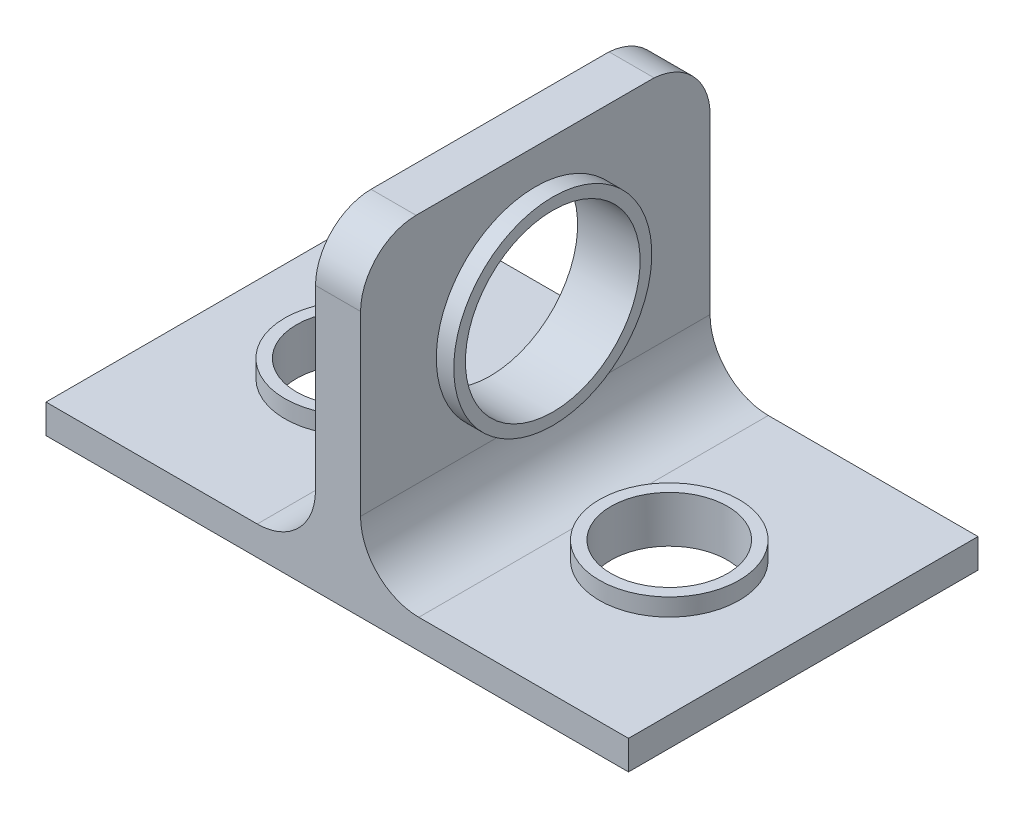
ISO-10303-21;
HEADER;
FILE_DESCRIPTION(('STEP AP214'),'2;1');
FILE_NAME('part.step','',(''),(''),'','','');
FILE_SCHEMA(('AUTOMOTIVE_DESIGN { 1 0 10303 214 1 1 1 1 }'));
ENDSEC;
DATA;
#1=APPLICATION_CONTEXT('core data for automotive mechanical design processes');
#2=APPLICATION_PROTOCOL_DEFINITION('international standard','automotive_design',2000,#1);
#3=PRODUCT_CONTEXT('',#1,'mechanical');
#4=PRODUCT('Part','Part','',(#3));
#5=PRODUCT_RELATED_PRODUCT_CATEGORY('part','',(#4));
#6=PRODUCT_DEFINITION_FORMATION('','',#4);
#7=PRODUCT_DEFINITION_CONTEXT('part definition',#1,'design');
#8=PRODUCT_DEFINITION('design','',#6,#7);
#9=PRODUCT_DEFINITION_SHAPE('','',#8);
#10=(LENGTH_UNIT() NAMED_UNIT(*) SI_UNIT(.MILLI.,.METRE.));
#11=(NAMED_UNIT(*) PLANE_ANGLE_UNIT() SI_UNIT($,.RADIAN.));
#12=(NAMED_UNIT(*) SI_UNIT($,.STERADIAN.) SOLID_ANGLE_UNIT());
#13=UNCERTAINTY_MEASURE_WITH_UNIT(LENGTH_MEASURE(1.E-05),#10,'distance_accuracy_value','');
#14=(GEOMETRIC_REPRESENTATION_CONTEXT(3) GLOBAL_UNCERTAINTY_ASSIGNED_CONTEXT((#13)) GLOBAL_UNIT_ASSIGNED_CONTEXT((#10,
#11,#12)) REPRESENTATION_CONTEXT('',''));
#15=CARTESIAN_POINT('',(0.,0.,0.));
#16=DIRECTION('',(0.,0.,1.));
#17=DIRECTION('',(1.,0.,0.));
#18=AXIS2_PLACEMENT_3D('',#15,#16,#17);
#19=CARTESIAN_POINT('',(-47.4944166202931,-8.60000000000001,60.));
#20=DIRECTION('',(1.,0.,0.));
#21=DIRECTION('',(0.,0.,-1.));
#22=AXIS2_PLACEMENT_3D('',#19,#20,#21);
#23=PLANE('',#22);
#24=DIRECTION('',(0.,-1.,0.));
#25=VECTOR('',#24,1.);
#26=CARTESIAN_POINT('',(-47.4944166202931,-8.60000000000001,0.));
#27=LINE('',#26,#25);
#28=CARTESIAN_POINT('',(-47.4944166202931,-8.60000000000001,0.));
#29=VERTEX_POINT('',#28);
#30=CARTESIAN_POINT('',(-47.4944166202931,-13.6,0.));
#31=VERTEX_POINT('',#30);
#32=EDGE_CURVE('E157',#29,#31,#27,.T.);
#33=ORIENTED_EDGE('',*,*,#32,.T.);
#34=DIRECTION('',(0.,0.,-1.));
#35=VECTOR('',#34,1.);
#36=CARTESIAN_POINT('',(-47.4944166202931,-13.6,60.));
#37=LINE('',#36,#35);
#38=CARTESIAN_POINT('',(-47.4944166202931,-13.6,60.));
#39=VERTEX_POINT('',#38);
#40=EDGE_CURVE('E204',#39,#31,#37,.T.);
#41=ORIENTED_EDGE('',*,*,#40,.F.);
#42=DIRECTION('',(0.,-1.,0.));
#43=VECTOR('',#42,1.);
#44=CARTESIAN_POINT('',(-47.4944166202931,-8.60000000000001,60.));
#45=LINE('',#44,#43);
#46=CARTESIAN_POINT('',(-47.4944166202931,-8.60000000000001,60.));
#47=VERTEX_POINT('',#46);
#48=EDGE_CURVE('E179',#47,#39,#45,.T.);
#49=ORIENTED_EDGE('',*,*,#48,.F.);
#50=DIRECTION('',(0.,0.,-1.));
#51=VECTOR('',#50,1.);
#52=CARTESIAN_POINT('',(-47.4944166202931,-8.60000000000001,60.));
#53=LINE('',#52,#51);
#54=EDGE_CURVE('E156',#47,#29,#53,.T.);
#55=ORIENTED_EDGE('',*,*,#54,.T.);
#56=EDGE_LOOP('',(#33,#41,#49,#55));
#57=FACE_BOUND('',#56,.T.);
#58=ADVANCED_FACE('F35',(#57),#23,.F.);
#59=CARTESIAN_POINT('',(-47.4944166202931,-13.6,60.));
#60=DIRECTION('',(0.,1.,0.));
#61=DIRECTION('',(0.,0.,1.));
#62=AXIS2_PLACEMENT_3D('',#59,#60,#61);
#63=PLANE('',#62);
#64=CARTESIAN_POINT('',(-24.4944166202931,-13.6,30.));
#65=DIRECTION('',(0.,1.,0.));
#66=DIRECTION('',(0.,0.,1.));
#67=AXIS2_PLACEMENT_3D('',#64,#65,#66);
#68=CIRCLE('',#67,10.);
#69=CARTESIAN_POINT('',(-24.4944166202931,-13.6,40.));
#70=VERTEX_POINT('',#69);
#71=EDGE_CURVE('E216',#70,#70,#68,.T.);
#72=ORIENTED_EDGE('',*,*,#71,.T.);
#73=EDGE_LOOP('',(#72));
#74=FACE_BOUND('',#73,.T.);
#75=CARTESIAN_POINT('',(29.5055833797069,-13.6,30.));
#76=DIRECTION('',(0.,1.,0.));
#77=DIRECTION('',(0.,0.,1.));
#78=AXIS2_PLACEMENT_3D('',#75,#76,#77);
#79=CIRCLE('',#78,10.);
#80=CARTESIAN_POINT('',(29.5055833797069,-13.6,40.));
#81=VERTEX_POINT('',#80);
#82=EDGE_CURVE('E213',#81,#81,#79,.T.);
#83=ORIENTED_EDGE('',*,*,#82,.T.);
#84=EDGE_LOOP('',(#83));
#85=FACE_BOUND('',#84,.T.);
#86=DIRECTION('',(1.,0.,0.));
#87=VECTOR('',#86,1.);
#88=CARTESIAN_POINT('',(-47.4944166202931,-13.6,0.));
#89=LINE('',#88,#87);
#90=CARTESIAN_POINT('',(52.5055833797069,-13.6,0.));
#91=VERTEX_POINT('',#90);
#92=EDGE_CURVE('E160',#31,#91,#89,.T.);
#93=ORIENTED_EDGE('',*,*,#92,.T.);
#94=DIRECTION('',(0.,0.,-1.));
#95=VECTOR('',#94,1.);
#96=CARTESIAN_POINT('',(52.5055833797069,-13.6,60.));
#97=LINE('',#96,#95);
#98=CARTESIAN_POINT('',(52.5055833797069,-13.6,60.));
#99=VERTEX_POINT('',#98);
#100=EDGE_CURVE('E201',#99,#91,#97,.T.);
#101=ORIENTED_EDGE('',*,*,#100,.F.);
#102=DIRECTION('',(1.,0.,0.));
#103=VECTOR('',#102,1.);
#104=CARTESIAN_POINT('',(-47.4944166202931,-13.6,60.));
#105=LINE('',#104,#103);
#106=EDGE_CURVE('E244',#39,#99,#105,.T.);
#107=ORIENTED_EDGE('',*,*,#106,.F.);
#108=ORIENTED_EDGE('',*,*,#40,.T.);
#109=EDGE_LOOP('',(#93,#101,#107,#108));
#110=FACE_BOUND('',#109,.T.);
#111=ADVANCED_FACE('F297',(#74,#85,#110),#63,.F.);
#112=CARTESIAN_POINT('',(52.5055833797069,-13.6,60.));
#113=DIRECTION('',(-1.,0.,0.));
#114=DIRECTION('',(0.,0.,1.));
#115=AXIS2_PLACEMENT_3D('',#112,#113,#114);
#116=PLANE('',#115);
#117=DIRECTION('',(0.,1.,0.));
#118=VECTOR('',#117,1.);
#119=CARTESIAN_POINT('',(52.5055833797069,-13.6,0.));
#120=LINE('',#119,#118);
#121=CARTESIAN_POINT('',(52.5055833797069,-8.60000000000001,0.));
#122=VERTEX_POINT('',#121);
#123=EDGE_CURVE('E163',#91,#122,#120,.T.);
#124=ORIENTED_EDGE('',*,*,#123,.T.);
#125=DIRECTION('',(0.,0.,-1.));
#126=VECTOR('',#125,1.);
#127=CARTESIAN_POINT('',(52.5055833797069,-8.60000000000001,60.));
#128=LINE('',#127,#126);
#129=CARTESIAN_POINT('',(52.5055833797069,-8.60000000000001,60.));
#130=VERTEX_POINT('',#129);
#131=EDGE_CURVE('E198',#130,#122,#128,.T.);
#132=ORIENTED_EDGE('',*,*,#131,.F.);
#133=DIRECTION('',(0.,1.,0.));
#134=VECTOR('',#133,1.);
#135=CARTESIAN_POINT('',(52.5055833797069,-13.6,60.));
#136=LINE('',#135,#134);
#137=EDGE_CURVE('E246',#99,#130,#136,.T.);
#138=ORIENTED_EDGE('',*,*,#137,.F.);
#139=ORIENTED_EDGE('',*,*,#100,.T.);
#140=EDGE_LOOP('',(#124,#132,#138,#139));
#141=FACE_BOUND('',#140,.T.);
#142=ADVANCED_FACE('F300',(#141),#116,.F.);
#143=CARTESIAN_POINT('',(52.5055833797069,-8.60000000000001,60.));
#144=DIRECTION('',(0.,-1.,0.));
#145=DIRECTION('',(1.,0.,0.));
#146=AXIS2_PLACEMENT_3D('',#143,#144,#145);
#147=PLANE('',#146);
#148=CARTESIAN_POINT('',(29.5055833797069,-8.60000000000001,30.));
#149=DIRECTION('',(0.,-1.,0.));
#150=DIRECTION('',(1.,0.,0.));
#151=AXIS2_PLACEMENT_3D('',#148,#149,#150);
#152=CIRCLE('',#151,12.);
#153=CARTESIAN_POINT('',(41.5055833797069,-8.60000000000001,30.));
#154=VERTEX_POINT('',#153);
#155=EDGE_CURVE('E210',#154,#154,#152,.F.);
#156=ORIENTED_EDGE('',*,*,#155,.F.);
#157=EDGE_LOOP('',(#156));
#158=FACE_BOUND('',#157,.T.);
#159=DIRECTION('',(-1.,0.,0.));
#160=VECTOR('',#159,1.);
#161=CARTESIAN_POINT('',(52.5055833797069,-8.60000000000001,0.));
#162=LINE('',#161,#160);
#163=CARTESIAN_POINT('',(16.5055833797069,-8.60000000000002,0.));
#164=VERTEX_POINT('',#163);
#165=EDGE_CURVE('E165',#122,#164,#162,.T.);
#166=ORIENTED_EDGE('',*,*,#165,.T.);
#167=DIRECTION('',(0.,0.,-1.));
#168=VECTOR('',#167,1.);
#169=CARTESIAN_POINT('',(16.5055833797069,-8.60000000000002,60.));
#170=LINE('',#169,#168);
#171=CARTESIAN_POINT('',(16.5055833797069,-8.60000000000002,60.));
#172=VERTEX_POINT('',#171);
#173=EDGE_CURVE('E195',#172,#164,#170,.T.);
#174=ORIENTED_EDGE('',*,*,#173,.F.);
#175=DIRECTION('',(-1.,0.,0.));
#176=VECTOR('',#175,1.);
#177=CARTESIAN_POINT('',(52.5055833797069,-8.60000000000001,60.));
#178=LINE('',#177,#176);
#179=EDGE_CURVE('E149',#130,#172,#178,.T.);
#180=ORIENTED_EDGE('',*,*,#179,.F.);
#181=ORIENTED_EDGE('',*,*,#131,.T.);
#182=EDGE_LOOP('',(#166,#174,#180,#181));
#183=FACE_BOUND('',#182,.T.);
#184=ADVANCED_FACE('F252',(#158,#183),#147,.F.);
#185=CARTESIAN_POINT('',(16.5055833797069,1.39999999999998,60.));
#186=DIRECTION('',(0.,0.,-1.));
#187=DIRECTION('',(-1.,0.,0.));
#188=AXIS2_PLACEMENT_3D('',#185,#186,#187);
#189=CYLINDRICAL_SURFACE('',#188,10.);
#190=CARTESIAN_POINT('',(16.5055833797069,1.39999999999998,0.));
#191=DIRECTION('',(0.,0.,-1.));
#192=DIRECTION('',(-1.,0.,0.));
#193=AXIS2_PLACEMENT_3D('',#190,#191,#192);
#194=CIRCLE('',#193,10.);
#195=CARTESIAN_POINT('',(6.50558337970687,1.39999999999998,0.));
#196=VERTEX_POINT('',#195);
#197=EDGE_CURVE('E167',#164,#196,#194,.T.);
#198=ORIENTED_EDGE('',*,*,#197,.T.);
#199=DIRECTION('',(0.,0.,-1.));
#200=VECTOR('',#199,1.);
#201=CARTESIAN_POINT('',(6.50558337970687,1.39999999999998,60.));
#202=LINE('',#201,#200);
#203=CARTESIAN_POINT('',(6.50558337970687,1.39999999999999,30.));
#204=VERTEX_POINT('',#203);
#205=EDGE_CURVE('E192',#204,#196,#202,.T.);
#206=ORIENTED_EDGE('',*,*,#205,.F.);
#207=CARTESIAN_POINT('',(6.50558337970687,1.39999999999998,60.));
#208=VERTEX_POINT('',#207);
#209=EDGE_CURVE('E193',#208,#204,#202,.T.);
#210=ORIENTED_EDGE('',*,*,#209,.F.);
#211=CARTESIAN_POINT('',(16.5055833797069,1.39999999999998,60.));
#212=DIRECTION('',(0.,0.,-1.));
#213=DIRECTION('',(-1.,0.,0.));
#214=AXIS2_PLACEMENT_3D('',#211,#212,#213);
#215=CIRCLE('',#214,10.);
#216=EDGE_CURVE('E143',#172,#208,#215,.T.);
#217=ORIENTED_EDGE('',*,*,#216,.F.);
#218=ORIENTED_EDGE('',*,*,#173,.T.);
#219=EDGE_LOOP('',(#198,#206,#210,#217,#218));
#220=FACE_BOUND('',#219,.T.);
#221=ADVANCED_FACE('F256',(#220),#189,.F.);
#222=CARTESIAN_POINT('',(6.50558337970688,41.4,60.));
#223=DIRECTION('',(-1.,0.,0.));
#224=DIRECTION('',(0.,-1.,0.));
#225=AXIS2_PLACEMENT_3D('',#222,#223,#224);
#226=PLANE('',#225);
#227=ORIENTED_EDGE('',*,*,#209,.T.);
#228=CARTESIAN_POINT('',(6.50558337970687,18.4,30.));
#229=DIRECTION('',(-1.,0.,0.));
#230=DIRECTION('',(0.,-1.,0.));
#231=AXIS2_PLACEMENT_3D('',#228,#229,#230);
#232=CIRCLE('',#231,17.);
#233=EDGE_CURVE('E38',#204,#204,#232,.T.);
#234=ORIENTED_EDGE('',*,*,#233,.T.);
#235=ORIENTED_EDGE('',*,*,#205,.T.);
#236=DIRECTION('',(0.,1.,0.));
#237=VECTOR('',#236,1.);
#238=CARTESIAN_POINT('',(6.50558337970688,41.4,0.));
#239=LINE('',#238,#237);
#240=CARTESIAN_POINT('',(6.50558337970688,31.7930045429532,0.));
#241=VERTEX_POINT('',#240);
#242=EDGE_CURVE('E170',#196,#241,#239,.T.);
#243=ORIENTED_EDGE('',*,*,#242,.T.);
#244=CARTESIAN_POINT('',(6.50558337970688,31.0157188590854,10.3842811409146));
#245=DIRECTION('',(1.,0.,0.));
#246=DIRECTION('',(0.,1.,0.));
#247=AXIS2_PLACEMENT_3D('',#244,#245,#246);
#248=CIRCLE('',#247,10.4133312560343);
#249=CARTESIAN_POINT('',(6.50558337970688,41.4,9.60699545704689));
#250=VERTEX_POINT('',#249);
#251=EDGE_CURVE('E258',#250,#241,#248,.F.);
#252=ORIENTED_EDGE('',*,*,#251,.F.);
#253=DIRECTION('',(0.,0.,-1.));
#254=VECTOR('',#253,1.);
#255=CARTESIAN_POINT('',(6.50558337970688,41.4,60.));
#256=LINE('',#255,#254);
#257=CARTESIAN_POINT('',(6.50558337970688,41.4,50.4696948244647));
#258=VERTEX_POINT('',#257);
#259=EDGE_CURVE('E137',#258,#250,#256,.T.);
#260=ORIENTED_EDGE('',*,*,#259,.F.);
#261=CARTESIAN_POINT('',(6.50558337970688,31.7930045429532,50.3930045429532));
#262=DIRECTION('',(1.,0.,0.));
#263=DIRECTION('',(0.,1.,0.));
#264=AXIS2_PLACEMENT_3D('',#261,#262,#263);
#265=CIRCLE('',#264,9.6073015519966);
#266=CARTESIAN_POINT('',(6.50558337970688,31.8696948244639,60.));
#267=VERTEX_POINT('',#266);
#268=EDGE_CURVE('E124',#267,#258,#265,.F.);
#269=ORIENTED_EDGE('',*,*,#268,.F.);
#270=DIRECTION('',(0.,1.,0.));
#271=VECTOR('',#270,1.);
#272=CARTESIAN_POINT('',(6.50558337970688,41.4,60.));
#273=LINE('',#272,#271);
#274=EDGE_CURVE('E134',#208,#267,#273,.T.);
#275=ORIENTED_EDGE('',*,*,#274,.F.);
#276=EDGE_LOOP('',(#227,#234,#235,#243,#252,#260,#269,#275));
#277=FACE_BOUND('',#276,.T.);
#278=ADVANCED_FACE('F133',(#277),#226,.F.);
#279=CARTESIAN_POINT('',(6.50558337970688,41.4,60.));
#280=DIRECTION('',(0.,-1.,0.));
#281=DIRECTION('',(0.,0.,-1.));
#282=AXIS2_PLACEMENT_3D('',#279,#280,#281);
#283=PLANE('',#282);
#284=ORIENTED_EDGE('',*,*,#259,.T.);
#285=DIRECTION('',(1.,0.,0.));
#286=VECTOR('',#285,1.);
#287=CARTESIAN_POINT('',(-16.4944166202931,41.4,9.60699545704689));
#288=LINE('',#287,#286);
#289=CARTESIAN_POINT('',(-1.22774995362641,41.4,9.60699545704689));
#290=VERTEX_POINT('',#289);
#291=EDGE_CURVE('E139',#290,#250,#288,.T.);
#292=ORIENTED_EDGE('',*,*,#291,.F.);
#293=DIRECTION('',(0.,0.,-1.));
#294=VECTOR('',#293,1.);
#295=CARTESIAN_POINT('',(-1.22774995362641,41.4,60.));
#296=LINE('',#295,#294);
#297=CARTESIAN_POINT('',(-1.22774995362641,41.4,50.4696948244647));
#298=VERTEX_POINT('',#297);
#299=EDGE_CURVE('E188',#298,#290,#296,.T.);
#300=ORIENTED_EDGE('',*,*,#299,.F.);
#301=DIRECTION('',(1.,0.,0.));
#302=VECTOR('',#301,1.);
#303=CARTESIAN_POINT('',(-16.4944166202931,41.4,50.4696948244647));
#304=LINE('',#303,#302);
#305=EDGE_CURVE('E138',#298,#258,#304,.T.);
#306=ORIENTED_EDGE('',*,*,#305,.T.);
#307=EDGE_LOOP('',(#284,#292,#300,#306));
#308=FACE_BOUND('',#307,.T.);
#309=ADVANCED_FACE('F275',(#308),#283,.F.);
#310=CARTESIAN_POINT('',(-1.22774995362641,41.4,60.));
#311=DIRECTION('',(1.,0.,0.));
#312=DIRECTION('',(0.,1.,0.));
#313=AXIS2_PLACEMENT_3D('',#310,#311,#312);
#314=PLANE('',#313);
#315=CARTESIAN_POINT('',(-1.2277499536264,18.4,30.));
#316=DIRECTION('',(1.,0.,0.));
#317=DIRECTION('',(0.,1.,0.));
#318=AXIS2_PLACEMENT_3D('',#315,#316,#317);
#319=CIRCLE('',#318,15.);
#320=CARTESIAN_POINT('',(-1.22774995362641,33.4,30.));
#321=VERTEX_POINT('',#320);
#322=EDGE_CURVE('E217',#321,#321,#319,.T.);
#323=ORIENTED_EDGE('',*,*,#322,.T.);
#324=EDGE_LOOP('',(#323));
#325=FACE_BOUND('',#324,.T.);
#326=ORIENTED_EDGE('',*,*,#299,.T.);
#327=CARTESIAN_POINT('',(-1.22774995362641,31.0157188590854,10.3842811409146));
#328=DIRECTION('',(1.,0.,0.));
#329=DIRECTION('',(0.,1.,0.));
#330=AXIS2_PLACEMENT_3D('',#327,#328,#329);
#331=CIRCLE('',#330,10.4133312560343);
#332=CARTESIAN_POINT('',(-1.2277499536264,31.7930045429532,0.));
#333=VERTEX_POINT('',#332);
#334=EDGE_CURVE('E224',#290,#333,#331,.F.);
#335=ORIENTED_EDGE('',*,*,#334,.T.);
#336=DIRECTION('',(0.,-1.,0.));
#337=VECTOR('',#336,1.);
#338=CARTESIAN_POINT('',(-1.22774995362641,41.4,0.));
#339=LINE('',#338,#337);
#340=CARTESIAN_POINT('',(-1.2277499536264,1.40000000000006,0.));
#341=VERTEX_POINT('',#340);
#342=EDGE_CURVE('E173',#333,#341,#339,.T.);
#343=ORIENTED_EDGE('',*,*,#342,.T.);
#344=DIRECTION('',(0.,0.,-1.));
#345=VECTOR('',#344,1.);
#346=CARTESIAN_POINT('',(-1.2277499536264,1.40000000000006,60.));
#347=LINE('',#346,#345);
#348=CARTESIAN_POINT('',(-1.2277499536264,1.40000000000006,60.));
#349=VERTEX_POINT('',#348);
#350=EDGE_CURVE('E185',#349,#341,#347,.T.);
#351=ORIENTED_EDGE('',*,*,#350,.F.);
#352=DIRECTION('',(0.,-1.,0.));
#353=VECTOR('',#352,1.);
#354=CARTESIAN_POINT('',(-1.22774995362641,41.4,60.));
#355=LINE('',#354,#353);
#356=CARTESIAN_POINT('',(-1.2277499536264,31.8696948244639,60.));
#357=VERTEX_POINT('',#356);
#358=EDGE_CURVE('E145',#357,#349,#355,.T.);
#359=ORIENTED_EDGE('',*,*,#358,.F.);
#360=CARTESIAN_POINT('',(-1.22774995362641,31.7930045429532,50.3930045429532));
#361=DIRECTION('',(1.,0.,0.));
#362=DIRECTION('',(0.,1.,0.));
#363=AXIS2_PLACEMENT_3D('',#360,#361,#362);
#364=CIRCLE('',#363,9.6073015519966);
#365=EDGE_CURVE('E55',#357,#298,#364,.F.);
#366=ORIENTED_EDGE('',*,*,#365,.T.);
#367=EDGE_LOOP('',(#326,#335,#343,#351,#359,#366));
#368=FACE_BOUND('',#367,.T.);
#369=ADVANCED_FACE('F276',(#325,#368),#314,.F.);
#370=CARTESIAN_POINT('',(-11.2277499536264,1.39999999999999,60.));
#371=DIRECTION('',(0.,0.,-1.));
#372=DIRECTION('',(-1.,0.,0.));
#373=AXIS2_PLACEMENT_3D('',#370,#371,#372);
#374=CYLINDRICAL_SURFACE('',#373,10.);
#375=CARTESIAN_POINT('',(-11.2277499536264,1.39999999999999,0.));
#376=DIRECTION('',(0.,0.,-1.));
#377=DIRECTION('',(-1.,0.,0.));
#378=AXIS2_PLACEMENT_3D('',#375,#376,#377);
#379=CIRCLE('',#378,10.);
#380=CARTESIAN_POINT('',(-11.2277499536265,-8.60000000000001,0.));
#381=VERTEX_POINT('',#380);
#382=EDGE_CURVE('E175',#341,#381,#379,.T.);
#383=ORIENTED_EDGE('',*,*,#382,.T.);
#384=DIRECTION('',(0.,0.,-1.));
#385=VECTOR('',#384,1.);
#386=CARTESIAN_POINT('',(-11.2277499536265,-8.60000000000001,60.));
#387=LINE('',#386,#385);
#388=CARTESIAN_POINT('',(-11.2277499536265,-8.60000000000001,60.));
#389=VERTEX_POINT('',#388);
#390=EDGE_CURVE('E182',#389,#381,#387,.T.);
#391=ORIENTED_EDGE('',*,*,#390,.F.);
#392=CARTESIAN_POINT('',(-11.2277499536264,1.39999999999999,60.));
#393=DIRECTION('',(0.,0.,-1.));
#394=DIRECTION('',(-1.,0.,0.));
#395=AXIS2_PLACEMENT_3D('',#392,#393,#394);
#396=CIRCLE('',#395,10.);
#397=EDGE_CURVE('E147',#349,#389,#396,.T.);
#398=ORIENTED_EDGE('',*,*,#397,.F.);
#399=ORIENTED_EDGE('',*,*,#350,.T.);
#400=EDGE_LOOP('',(#383,#391,#398,#399));
#401=FACE_BOUND('',#400,.T.);
#402=ADVANCED_FACE('F286',(#401),#374,.F.);
#403=CARTESIAN_POINT('',(-11.2277499536265,-8.60000000000001,60.));
#404=DIRECTION('',(0.,-1.,0.));
#405=DIRECTION('',(1.,0.,0.));
#406=AXIS2_PLACEMENT_3D('',#403,#404,#405);
#407=PLANE('',#406);
#408=CARTESIAN_POINT('',(-24.4944166202931,-8.60000000000001,30.));
#409=DIRECTION('',(0.,-1.,0.));
#410=DIRECTION('',(1.,0.,0.));
#411=AXIS2_PLACEMENT_3D('',#408,#409,#410);
#412=CIRCLE('',#411,12.);
#413=CARTESIAN_POINT('',(-12.4944166202931,-8.60000000000001,30.));
#414=VERTEX_POINT('',#413);
#415=EDGE_CURVE('E207',#414,#414,#412,.F.);
#416=ORIENTED_EDGE('',*,*,#415,.F.);
#417=EDGE_LOOP('',(#416));
#418=FACE_BOUND('',#417,.T.);
#419=DIRECTION('',(-1.,0.,0.));
#420=VECTOR('',#419,1.);
#421=CARTESIAN_POINT('',(-11.2277499536265,-8.60000000000001,0.));
#422=LINE('',#421,#420);
#423=EDGE_CURVE('E177',#381,#29,#422,.T.);
#424=ORIENTED_EDGE('',*,*,#423,.T.);
#425=ORIENTED_EDGE('',*,*,#54,.F.);
#426=DIRECTION('',(-1.,0.,0.));
#427=VECTOR('',#426,1.);
#428=CARTESIAN_POINT('',(-11.2277499536265,-8.60000000000001,60.));
#429=LINE('',#428,#427);
#430=EDGE_CURVE('E154',#389,#47,#429,.T.);
#431=ORIENTED_EDGE('',*,*,#430,.F.);
#432=ORIENTED_EDGE('',*,*,#390,.T.);
#433=EDGE_LOOP('',(#424,#425,#431,#432));
#434=FACE_BOUND('',#433,.T.);
#435=ADVANCED_FACE('F290',(#418,#434),#407,.F.);
#436=CARTESIAN_POINT('',(16.5055833797069,1.39999999999998,60.));
#437=DIRECTION('',(0.,0.,-1.));
#438=DIRECTION('',(-1.,0.,0.));
#439=AXIS2_PLACEMENT_3D('',#436,#437,#438);
#440=PLANE('',#439);
#441=ORIENTED_EDGE('',*,*,#274,.T.);
#442=DIRECTION('',(1.,0.,0.));
#443=VECTOR('',#442,1.);
#444=CARTESIAN_POINT('',(-16.4944166202931,31.8696948244639,60.));
#445=LINE('',#444,#443);
#446=EDGE_CURVE('E11',#267,#357,#445,.F.);
#447=ORIENTED_EDGE('',*,*,#446,.T.);
#448=ORIENTED_EDGE('',*,*,#358,.T.);
#449=ORIENTED_EDGE('',*,*,#397,.T.);
#450=ORIENTED_EDGE('',*,*,#430,.T.);
#451=ORIENTED_EDGE('',*,*,#48,.T.);
#452=ORIENTED_EDGE('',*,*,#106,.T.);
#453=ORIENTED_EDGE('',*,*,#137,.T.);
#454=ORIENTED_EDGE('',*,*,#179,.T.);
#455=ORIENTED_EDGE('',*,*,#216,.T.);
#456=EDGE_LOOP('',(#441,#447,#448,#449,#450,#451,#452,#453,#454,#455));
#457=FACE_BOUND('',#456,.T.);
#458=ADVANCED_FACE('F141',(#457),#440,.F.);
#459=CARTESIAN_POINT('',(16.5055833797069,1.39999999999998,0.));
#460=DIRECTION('',(0.,0.,-1.));
#461=DIRECTION('',(-1.,0.,0.));
#462=AXIS2_PLACEMENT_3D('',#459,#460,#461);
#463=PLANE('',#462);
#464=DIRECTION('',(1.,0.,0.));
#465=VECTOR('',#464,1.);
#466=CARTESIAN_POINT('',(-16.4944166202931,31.7930045429532,0.));
#467=LINE('',#466,#465);
#468=EDGE_CURVE('E43',#241,#333,#467,.F.);
#469=ORIENTED_EDGE('',*,*,#468,.F.);
#470=ORIENTED_EDGE('',*,*,#242,.F.);
#471=ORIENTED_EDGE('',*,*,#197,.F.);
#472=ORIENTED_EDGE('',*,*,#165,.F.);
#473=ORIENTED_EDGE('',*,*,#123,.F.);
#474=ORIENTED_EDGE('',*,*,#92,.F.);
#475=ORIENTED_EDGE('',*,*,#32,.F.);
#476=ORIENTED_EDGE('',*,*,#423,.F.);
#477=ORIENTED_EDGE('',*,*,#382,.F.);
#478=ORIENTED_EDGE('',*,*,#342,.F.);
#479=EDGE_LOOP('',(#469,#470,#471,#472,#473,#474,#475,#476,#477,#478));
#480=FACE_BOUND('',#479,.T.);
#481=ADVANCED_FACE('F281',(#480),#463,.T.);
#482=CARTESIAN_POINT('',(-24.4944166202931,-5.60000000000001,30.));
#483=DIRECTION('',(0.,1.,0.));
#484=DIRECTION('',(-1.,0.,0.));
#485=AXIS2_PLACEMENT_3D('',#482,#483,#484);
#486=PLANE('',#485);
#487=CARTESIAN_POINT('',(-24.4944166202931,-5.60000000000001,30.));
#488=DIRECTION('',(0.,1.,0.));
#489=DIRECTION('',(-1.,0.,0.));
#490=AXIS2_PLACEMENT_3D('',#487,#488,#489);
#491=CIRCLE('',#490,12.);
#492=CARTESIAN_POINT('',(-36.4944166202931,-5.60000000000001,30.));
#493=VERTEX_POINT('',#492);
#494=EDGE_CURVE('E161',#493,#493,#491,.T.);
#495=ORIENTED_EDGE('',*,*,#494,.T.);
#496=EDGE_LOOP('',(#495));
#497=FACE_BOUND('',#496,.T.);
#498=CARTESIAN_POINT('',(-24.4944166202931,-5.60000000000001,30.));
#499=DIRECTION('',(0.,1.,0.));
#500=DIRECTION('',(-1.,0.,0.));
#501=AXIS2_PLACEMENT_3D('',#498,#499,#500);
#502=CIRCLE('',#501,10.);
#503=CARTESIAN_POINT('',(-34.4944166202931,-5.60000000000001,30.));
#504=VERTEX_POINT('',#503);
#505=EDGE_CURVE('E237',#504,#504,#502,.T.);
#506=ORIENTED_EDGE('',*,*,#505,.F.);
#507=EDGE_LOOP('',(#506));
#508=FACE_BOUND('',#507,.T.);
#509=ADVANCED_FACE('F391',(#497,#508),#486,.T.);
#510=CARTESIAN_POINT('',(-24.4944166202931,-5.60000000000001,30.));
#511=DIRECTION('',(0.,-1.,0.));
#512=DIRECTION('',(1.,0.,0.));
#513=AXIS2_PLACEMENT_3D('',#510,#511,#512);
#514=CYLINDRICAL_SURFACE('',#513,12.);
#515=ORIENTED_EDGE('',*,*,#494,.F.);
#516=EDGE_LOOP('',(#515));
#517=FACE_BOUND('',#516,.T.);
#518=ORIENTED_EDGE('',*,*,#415,.T.);
#519=EDGE_LOOP('',(#518));
#520=FACE_BOUND('',#519,.T.);
#521=ADVANCED_FACE('F335',(#517,#520),#514,.T.);
#522=CARTESIAN_POINT('',(-24.4944166202931,-5.60000000000001,30.));
#523=DIRECTION('',(0.,-1.,0.));
#524=DIRECTION('',(1.,0.,0.));
#525=AXIS2_PLACEMENT_3D('',#522,#523,#524);
#526=CYLINDRICAL_SURFACE('',#525,10.);
#527=ORIENTED_EDGE('',*,*,#505,.T.);
#528=EDGE_LOOP('',(#527));
#529=FACE_BOUND('',#528,.T.);
#530=ORIENTED_EDGE('',*,*,#71,.F.);
#531=EDGE_LOOP('',(#530));
#532=FACE_BOUND('',#531,.T.);
#533=ADVANCED_FACE('F329',(#529,#532),#526,.F.);
#534=CARTESIAN_POINT('',(29.5055833797069,-5.60000000000001,30.));
#535=DIRECTION('',(0.,1.,0.));
#536=DIRECTION('',(-1.,0.,0.));
#537=AXIS2_PLACEMENT_3D('',#534,#535,#536);
#538=PLANE('',#537);
#539=CARTESIAN_POINT('',(29.5055833797069,-5.60000000000001,30.));
#540=DIRECTION('',(0.,1.,0.));
#541=DIRECTION('',(-1.,0.,0.));
#542=AXIS2_PLACEMENT_3D('',#539,#540,#541);
#543=CIRCLE('',#542,12.);
#544=CARTESIAN_POINT('',(17.5055833797069,-5.60000000000001,30.));
#545=VERTEX_POINT('',#544);
#546=EDGE_CURVE('E234',#545,#545,#543,.T.);
#547=ORIENTED_EDGE('',*,*,#546,.T.);
#548=EDGE_LOOP('',(#547));
#549=FACE_BOUND('',#548,.T.);
#550=CARTESIAN_POINT('',(29.5055833797069,-5.60000000000001,30.));
#551=DIRECTION('',(0.,1.,0.));
#552=DIRECTION('',(-1.,0.,0.));
#553=AXIS2_PLACEMENT_3D('',#550,#551,#552);
#554=CIRCLE('',#553,10.);
#555=CARTESIAN_POINT('',(19.5055833797069,-5.60000000000001,30.));
#556=VERTEX_POINT('',#555);
#557=EDGE_CURVE('E220',#556,#556,#554,.T.);
#558=ORIENTED_EDGE('',*,*,#557,.F.);
#559=EDGE_LOOP('',(#558));
#560=FACE_BOUND('',#559,.T.);
#561=ADVANCED_FACE('F334',(#549,#560),#538,.T.);
#562=CARTESIAN_POINT('',(29.5055833797069,-5.60000000000001,30.));
#563=DIRECTION('',(0.,-1.,0.));
#564=DIRECTION('',(1.,0.,0.));
#565=AXIS2_PLACEMENT_3D('',#562,#563,#564);
#566=CYLINDRICAL_SURFACE('',#565,12.);
#567=ORIENTED_EDGE('',*,*,#546,.F.);
#568=EDGE_LOOP('',(#567));
#569=FACE_BOUND('',#568,.T.);
#570=ORIENTED_EDGE('',*,*,#155,.T.);
#571=EDGE_LOOP('',(#570));
#572=FACE_BOUND('',#571,.T.);
#573=ADVANCED_FACE('F324',(#569,#572),#566,.T.);
#574=CARTESIAN_POINT('',(29.5055833797069,-5.60000000000001,30.));
#575=DIRECTION('',(0.,-1.,0.));
#576=DIRECTION('',(1.,0.,0.));
#577=AXIS2_PLACEMENT_3D('',#574,#575,#576);
#578=CYLINDRICAL_SURFACE('',#577,10.);
#579=ORIENTED_EDGE('',*,*,#557,.T.);
#580=EDGE_LOOP('',(#579));
#581=FACE_BOUND('',#580,.T.);
#582=ORIENTED_EDGE('',*,*,#82,.F.);
#583=EDGE_LOOP('',(#582));
#584=FACE_BOUND('',#583,.T.);
#585=ADVANCED_FACE('F346',(#581,#584),#578,.F.);
#586=CARTESIAN_POINT('',(-16.4944166202931,31.0157188590854,10.3842811409146));
#587=DIRECTION('',(1.,0.,0.));
#588=DIRECTION('',(0.,1.,0.));
#589=AXIS2_PLACEMENT_3D('',#586,#587,#588);
#590=CYLINDRICAL_SURFACE('',#589,10.4133312560343);
#591=ORIENTED_EDGE('',*,*,#291,.T.);
#592=ORIENTED_EDGE('',*,*,#251,.T.);
#593=ORIENTED_EDGE('',*,*,#468,.T.);
#594=ORIENTED_EDGE('',*,*,#334,.F.);
#595=EDGE_LOOP('',(#591,#592,#593,#594));
#596=FACE_BOUND('',#595,.T.);
#597=ADVANCED_FACE('F271',(#596),#590,.T.);
#598=CARTESIAN_POINT('',(-16.4944166202931,31.7930045429532,50.3930045429532));
#599=DIRECTION('',(1.,0.,0.));
#600=DIRECTION('',(0.,1.,0.));
#601=AXIS2_PLACEMENT_3D('',#598,#599,#600);
#602=CYLINDRICAL_SURFACE('',#601,9.6073015519966);
#603=ORIENTED_EDGE('',*,*,#446,.F.);
#604=ORIENTED_EDGE('',*,*,#268,.T.);
#605=ORIENTED_EDGE('',*,*,#305,.F.);
#606=ORIENTED_EDGE('',*,*,#365,.F.);
#607=EDGE_LOOP('',(#603,#604,#605,#606));
#608=FACE_BOUND('',#607,.T.);
#609=ADVANCED_FACE('F123',(#608),#602,.T.);
#610=CARTESIAN_POINT('',(-16.4944166202931,18.4,30.));
#611=DIRECTION('',(1.,0.,0.));
#612=DIRECTION('',(0.,1.,0.));
#613=AXIS2_PLACEMENT_3D('',#610,#611,#612);
#614=CYLINDRICAL_SURFACE('',#613,15.);
#615=ORIENTED_EDGE('',*,*,#322,.F.);
#616=EDGE_LOOP('',(#615));
#617=FACE_BOUND('',#616,.T.);
#618=CARTESIAN_POINT('',(9.50558337970688,18.4,30.));
#619=DIRECTION('',(1.,0.,0.));
#620=DIRECTION('',(0.,1.,0.));
#621=AXIS2_PLACEMENT_3D('',#618,#619,#620);
#622=CIRCLE('',#621,15.);
#623=CARTESIAN_POINT('',(9.50558337970688,33.4,30.));
#624=VERTEX_POINT('',#623);
#625=EDGE_CURVE('E262',#624,#624,#622,.T.);
#626=ORIENTED_EDGE('',*,*,#625,.T.);
#627=EDGE_LOOP('',(#626));
#628=FACE_BOUND('',#627,.T.);
#629=ADVANCED_FACE('F408',(#617,#628),#614,.F.);
#630=CARTESIAN_POINT('',(3.50558337970687,18.4,30.));
#631=DIRECTION('',(1.,0.,0.));
#632=DIRECTION('',(0.,1.,0.));
#633=AXIS2_PLACEMENT_3D('',#630,#631,#632);
#634=CYLINDRICAL_SURFACE('',#633,17.);
#635=CARTESIAN_POINT('',(9.50558337970688,18.4,30.));
#636=DIRECTION('',(1.,0.,0.));
#637=DIRECTION('',(0.,1.,0.));
#638=AXIS2_PLACEMENT_3D('',#635,#636,#637);
#639=CIRCLE('',#638,17.);
#640=CARTESIAN_POINT('',(9.50558337970688,35.4,30.));
#641=VERTEX_POINT('',#640);
#642=EDGE_CURVE('E259',#641,#641,#639,.T.);
#643=ORIENTED_EDGE('',*,*,#642,.F.);
#644=EDGE_LOOP('',(#643));
#645=FACE_BOUND('',#644,.T.);
#646=ORIENTED_EDGE('',*,*,#233,.F.);
#647=EDGE_LOOP('',(#646));
#648=FACE_BOUND('',#647,.T.);
#649=ADVANCED_FACE('F433',(#645,#648),#634,.T.);
#650=CARTESIAN_POINT('',(9.50558337970687,0.,0.));
#651=DIRECTION('',(1.,0.,0.));
#652=DIRECTION('',(0.,1.,0.));
#653=AXIS2_PLACEMENT_3D('',#650,#651,#652);
#654=PLANE('',#653);
#655=ORIENTED_EDGE('',*,*,#625,.F.);
#656=EDGE_LOOP('',(#655));
#657=FACE_BOUND('',#656,.T.);
#658=ORIENTED_EDGE('',*,*,#642,.T.);
#659=EDGE_LOOP('',(#658));
#660=FACE_BOUND('',#659,.T.);
#661=ADVANCED_FACE('F444',(#657,#660),#654,.T.);
#662=CLOSED_SHELL('',(#58,#111,#142,#184,#221,#278,#309,#369,#402,#435,#458,#481,#509,#521,#533,
#561,#573,#585,#597,#609,#629,#649,#661));
#663=MANIFOLD_SOLID_BREP('B2',#662);
#664=ADVANCED_BREP_SHAPE_REPRESENTATION('',(#18,#663),#14);
#665=SHAPE_DEFINITION_REPRESENTATION(#9,#664);
ENDSEC;
END-ISO-10303-21;
